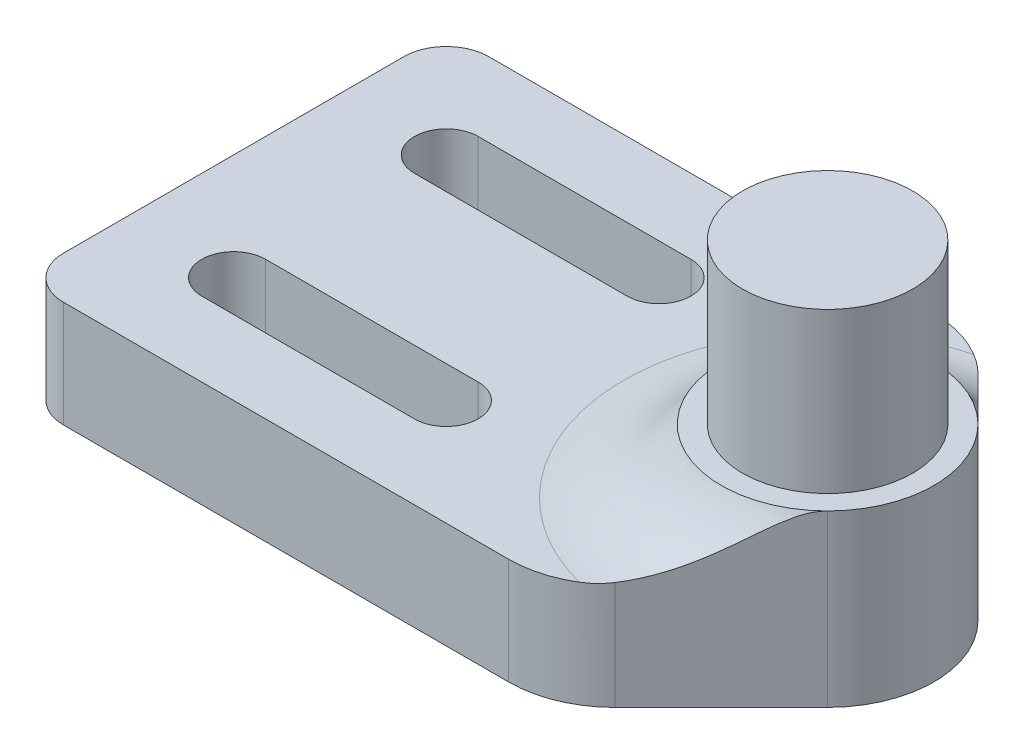
ISO-10303-21;
HEADER;
FILE_DESCRIPTION(('STEP AP214'),'2;1');
FILE_NAME('part.step','',(''),(''),'','','');
FILE_SCHEMA(('AUTOMOTIVE_DESIGN { 1 0 10303 214 1 1 1 1 }'));
ENDSEC;
DATA;
#1=APPLICATION_CONTEXT('core data for automotive mechanical design processes');
#2=APPLICATION_PROTOCOL_DEFINITION('international standard','automotive_design',2000,#1);
#3=PRODUCT_CONTEXT('',#1,'mechanical');
#4=PRODUCT('Part','Part','',(#3));
#5=PRODUCT_RELATED_PRODUCT_CATEGORY('part','',(#4));
#6=PRODUCT_DEFINITION_FORMATION('','',#4);
#7=PRODUCT_DEFINITION_CONTEXT('part definition',#1,'design');
#8=PRODUCT_DEFINITION('design','',#6,#7);
#9=PRODUCT_DEFINITION_SHAPE('','',#8);
#10=(LENGTH_UNIT() NAMED_UNIT(*) SI_UNIT(.MILLI.,.METRE.));
#11=(NAMED_UNIT(*) PLANE_ANGLE_UNIT() SI_UNIT($,.RADIAN.));
#12=(NAMED_UNIT(*) SI_UNIT($,.STERADIAN.) SOLID_ANGLE_UNIT());
#13=UNCERTAINTY_MEASURE_WITH_UNIT(LENGTH_MEASURE(1.E-05),#10,'distance_accuracy_value','');
#14=(GEOMETRIC_REPRESENTATION_CONTEXT(3) GLOBAL_UNCERTAINTY_ASSIGNED_CONTEXT((#13)) GLOBAL_UNIT_ASSIGNED_CONTEXT((#10,
#11,#12)) REPRESENTATION_CONTEXT('',''));
#15=CARTESIAN_POINT('',(0.,0.,0.));
#16=DIRECTION('',(0.,0.,1.));
#17=DIRECTION('',(1.,0.,0.));
#18=AXIS2_PLACEMENT_3D('',#15,#16,#17);
#19=CARTESIAN_POINT('',(0.,5.,0.));
#20=DIRECTION('',(0.,-1.,0.));
#21=DIRECTION('',(0.,0.,-1.));
#22=AXIS2_PLACEMENT_3D('',#19,#20,#21);
#23=PLANE('',#22);
#24=DIRECTION('',(-1.,0.,0.));
#25=VECTOR('',#24,1.);
#26=CARTESIAN_POINT('',(-12.5,5.,-10.));
#27=LINE('',#26,#25);
#28=CARTESIAN_POINT('',(10.4289321881345,5.,-10.));
#29=VERTEX_POINT('',#28);
#30=CARTESIAN_POINT('',(-10.5,5.,-10.));
#31=VERTEX_POINT('',#30);
#32=EDGE_CURVE('E259',#29,#31,#27,.T.);
#33=ORIENTED_EDGE('',*,*,#32,.T.);
#34=CARTESIAN_POINT('',(-10.5,5.,-8.00000000000001));
#35=DIRECTION('',(0.,-1.,0.));
#36=DIRECTION('',(0.,0.,-1.));
#37=AXIS2_PLACEMENT_3D('',#34,#35,#36);
#38=CIRCLE('',#37,2.);
#39=CARTESIAN_POINT('',(-12.5,5.,-8.));
#40=VERTEX_POINT('',#39);
#41=EDGE_CURVE('E41',#31,#40,#38,.F.);
#42=ORIENTED_EDGE('',*,*,#41,.T.);
#43=DIRECTION('',(0.,0.,1.));
#44=VECTOR('',#43,1.);
#45=CARTESIAN_POINT('',(-12.5,5.,10.));
#46=LINE('',#45,#44);
#47=CARTESIAN_POINT('',(-12.5,5.,8.));
#48=VERTEX_POINT('',#47);
#49=EDGE_CURVE('E258',#40,#48,#46,.T.);
#50=ORIENTED_EDGE('',*,*,#49,.T.);
#51=CARTESIAN_POINT('',(-10.5,5.,8.));
#52=DIRECTION('',(0.,-1.,0.));
#53=DIRECTION('',(0.,0.,-1.));
#54=AXIS2_PLACEMENT_3D('',#51,#52,#53);
#55=CIRCLE('',#54,2.);
#56=CARTESIAN_POINT('',(-10.5,5.,10.));
#57=VERTEX_POINT('',#56);
#58=EDGE_CURVE('E48',#48,#57,#55,.F.);
#59=ORIENTED_EDGE('',*,*,#58,.T.);
#60=DIRECTION('',(1.,0.,0.));
#61=VECTOR('',#60,1.);
#62=CARTESIAN_POINT('',(-12.5,5.,10.));
#63=LINE('',#62,#61);
#64=CARTESIAN_POINT('',(10.4289321881345,5.,10.));
#65=VERTEX_POINT('',#64);
#66=EDGE_CURVE('E266',#57,#65,#63,.T.);
#67=ORIENTED_EDGE('',*,*,#66,.T.);
#68=CARTESIAN_POINT('',(10.4289321881345,5.,5.));
#69=DIRECTION('',(0.,-1.,0.));
#70=DIRECTION('',(0.,0.,-1.));
#71=AXIS2_PLACEMENT_3D('',#68,#69,#70);
#72=CIRCLE('',#71,5.);
#73=CARTESIAN_POINT('',(13.0216266873913,5.,9.27527019421269));
#74=VERTEX_POINT('',#73);
#75=EDGE_CURVE('E293',#65,#74,#72,.F.);
#76=ORIENTED_EDGE('',*,*,#75,.T.);
#77=CARTESIAN_POINT('',(15.4289321881345,5.,0.));
#78=DIRECTION('',(0.,-1.,0.));
#79=DIRECTION('',(0.,0.,-1.));
#80=AXIS2_PLACEMENT_3D('',#77,#78,#79);
#81=CIRCLE('',#80,9.58257569495584);
#82=CARTESIAN_POINT('',(13.0216266873913,5.,-9.27527019421269));
#83=VERTEX_POINT('',#82);
#84=EDGE_CURVE('E204',#74,#83,#81,.T.);
#85=ORIENTED_EDGE('',*,*,#84,.T.);
#86=CARTESIAN_POINT('',(10.4289321881345,5.,-5.));
#87=DIRECTION('',(0.,-1.,0.));
#88=DIRECTION('',(0.,0.,-1.));
#89=AXIS2_PLACEMENT_3D('',#86,#87,#88);
#90=CIRCLE('',#89,5.);
#91=EDGE_CURVE('E296',#83,#29,#90,.F.);
#92=ORIENTED_EDGE('',*,*,#91,.T.);
#93=EDGE_LOOP('',(#33,#42,#50,#59,#67,#76,#85,#92));
#94=FACE_BOUND('',#93,.T.);
#95=CARTESIAN_POINT('',(-7.50000000000001,5.,-5.));
#96=DIRECTION('',(0.,1.,0.));
#97=DIRECTION('',(0.,0.,1.));
#98=AXIS2_PLACEMENT_3D('',#95,#96,#97);
#99=CIRCLE('',#98,1.5);
#100=CARTESIAN_POINT('',(-7.50000000000001,5.,-6.49999999999999));
#101=VERTEX_POINT('',#100);
#102=CARTESIAN_POINT('',(-7.50000000000001,5.,-3.5));
#103=VERTEX_POINT('',#102);
#104=EDGE_CURVE('E329',#101,#103,#99,.T.);
#105=ORIENTED_EDGE('',*,*,#104,.F.);
#106=DIRECTION('',(-1.,0.,0.));
#107=VECTOR('',#106,1.);
#108=CARTESIAN_POINT('',(-7.50000000000001,5.,-6.49999999999999));
#109=LINE('',#108,#107);
#110=CARTESIAN_POINT('',(2.49999999999999,5.,-6.5));
#111=VERTEX_POINT('',#110);
#112=EDGE_CURVE('E325',#111,#101,#109,.T.);
#113=ORIENTED_EDGE('',*,*,#112,.F.);
#114=CARTESIAN_POINT('',(2.5,5.,-5.));
#115=DIRECTION('',(0.,1.,0.));
#116=DIRECTION('',(0.,0.,1.));
#117=AXIS2_PLACEMENT_3D('',#114,#115,#116);
#118=CIRCLE('',#117,1.5);
#119=CARTESIAN_POINT('',(2.5,5.,-3.5));
#120=VERTEX_POINT('',#119);
#121=EDGE_CURVE('E341',#120,#111,#118,.T.);
#122=ORIENTED_EDGE('',*,*,#121,.F.);
#123=DIRECTION('',(1.,0.,0.));
#124=VECTOR('',#123,1.);
#125=CARTESIAN_POINT('',(-7.50000000000001,5.,-3.5));
#126=LINE('',#125,#124);
#127=EDGE_CURVE('E344',#103,#120,#126,.T.);
#128=ORIENTED_EDGE('',*,*,#127,.F.);
#129=EDGE_LOOP('',(#105,#113,#122,#128));
#130=FACE_BOUND('',#129,.T.);
#131=CARTESIAN_POINT('',(-7.50000000000001,5.,5.));
#132=DIRECTION('',(0.,1.,0.));
#133=DIRECTION('',(0.,0.,-1.));
#134=AXIS2_PLACEMENT_3D('',#131,#132,#133);
#135=CIRCLE('',#134,1.5);
#136=CARTESIAN_POINT('',(-7.50000000000001,5.,3.5));
#137=VERTEX_POINT('',#136);
#138=CARTESIAN_POINT('',(-7.50000000000001,5.,6.5));
#139=VERTEX_POINT('',#138);
#140=EDGE_CURVE('E360',#137,#139,#135,.T.);
#141=ORIENTED_EDGE('',*,*,#140,.F.);
#142=DIRECTION('',(-1.,0.,0.));
#143=VECTOR('',#142,1.);
#144=CARTESIAN_POINT('',(-7.50000000000001,5.,3.5));
#145=LINE('',#144,#143);
#146=CARTESIAN_POINT('',(2.50000000000001,5.,3.5));
#147=VERTEX_POINT('',#146);
#148=EDGE_CURVE('E356',#147,#137,#145,.T.);
#149=ORIENTED_EDGE('',*,*,#148,.F.);
#150=CARTESIAN_POINT('',(2.5,5.,5.));
#151=DIRECTION('',(0.,1.,0.));
#152=DIRECTION('',(0.,0.,-1.));
#153=AXIS2_PLACEMENT_3D('',#150,#151,#152);
#154=CIRCLE('',#153,1.5);
#155=CARTESIAN_POINT('',(2.49999999999999,5.,6.5));
#156=VERTEX_POINT('',#155);
#157=EDGE_CURVE('E370',#156,#147,#154,.T.);
#158=ORIENTED_EDGE('',*,*,#157,.F.);
#159=DIRECTION('',(1.,0.,0.));
#160=VECTOR('',#159,1.);
#161=CARTESIAN_POINT('',(-7.50000000000001,5.,6.5));
#162=LINE('',#161,#160);
#163=EDGE_CURVE('E373',#139,#156,#162,.T.);
#164=ORIENTED_EDGE('',*,*,#163,.F.);
#165=EDGE_LOOP('',(#141,#149,#158,#164));
#166=FACE_BOUND('',#165,.T.);
#167=ADVANCED_FACE('F33',(#94,#130,#166),#23,.F.);
#168=CARTESIAN_POINT('',(0.,0.,0.));
#169=DIRECTION('',(0.,-1.,0.));
#170=DIRECTION('',(0.,0.,-1.));
#171=AXIS2_PLACEMENT_3D('',#168,#169,#170);
#172=PLANE('',#171);
#173=DIRECTION('',(0.,0.,1.));
#174=VECTOR('',#173,1.);
#175=CARTESIAN_POINT('',(-12.5,0.,10.));
#176=LINE('',#175,#174);
#177=CARTESIAN_POINT('',(-12.5,0.,-8.));
#178=VERTEX_POINT('',#177);
#179=CARTESIAN_POINT('',(-12.5,0.,8.));
#180=VERTEX_POINT('',#179);
#181=EDGE_CURVE('E271',#178,#180,#176,.T.);
#182=ORIENTED_EDGE('',*,*,#181,.F.);
#183=CARTESIAN_POINT('',(-10.5,0.,-8.00000000000001));
#184=DIRECTION('',(0.,-1.,0.));
#185=DIRECTION('',(0.,0.,-1.));
#186=AXIS2_PLACEMENT_3D('',#183,#184,#185);
#187=CIRCLE('',#186,2.);
#188=CARTESIAN_POINT('',(-10.5,0.,-10.));
#189=VERTEX_POINT('',#188);
#190=EDGE_CURVE('E252',#178,#189,#187,.T.);
#191=ORIENTED_EDGE('',*,*,#190,.T.);
#192=DIRECTION('',(-1.,0.,0.));
#193=VECTOR('',#192,1.);
#194=CARTESIAN_POINT('',(-12.5,0.,-10.));
#195=LINE('',#194,#193);
#196=CARTESIAN_POINT('',(10.4289321881345,0.,-10.));
#197=VERTEX_POINT('',#196);
#198=EDGE_CURVE('E270',#197,#189,#195,.T.);
#199=ORIENTED_EDGE('',*,*,#198,.F.);
#200=CARTESIAN_POINT('',(10.4289321881345,0.,-5.));
#201=DIRECTION('',(0.,-1.,0.));
#202=DIRECTION('',(0.,0.,-1.));
#203=AXIS2_PLACEMENT_3D('',#200,#201,#202);
#204=CIRCLE('',#203,5.);
#205=CARTESIAN_POINT('',(13.9644660940673,0.,-8.53553390593272));
#206=VERTEX_POINT('',#205);
#207=EDGE_CURVE('E289',#197,#206,#204,.T.);
#208=ORIENTED_EDGE('',*,*,#207,.T.);
#209=DIRECTION('',(-0.707106781186544,0.,-0.707106781186551));
#210=VECTOR('',#209,1.);
#211=CARTESIAN_POINT('',(12.5,0.,-10.));
#212=LINE('',#211,#210);
#213=CARTESIAN_POINT('',(18.9644660940672,0.,-3.53553390593272));
#214=VERTEX_POINT('',#213);
#215=EDGE_CURVE('E177',#214,#206,#212,.T.);
#216=ORIENTED_EDGE('',*,*,#215,.F.);
#217=CARTESIAN_POINT('',(15.4289321881345,0.,0.));
#218=DIRECTION('',(0.,-1.,0.));
#219=DIRECTION('',(0.,0.,-1.));
#220=AXIS2_PLACEMENT_3D('',#217,#218,#219);
#221=CIRCLE('',#220,5.);
#222=CARTESIAN_POINT('',(18.9644660940672,0.,3.53553390593272));
#223=VERTEX_POINT('',#222);
#224=EDGE_CURVE('E180',#223,#214,#221,.F.);
#225=ORIENTED_EDGE('',*,*,#224,.F.);
#226=DIRECTION('',(0.707106781186544,0.,-0.707106781186551));
#227=VECTOR('',#226,1.);
#228=CARTESIAN_POINT('',(18.9644660940672,0.,3.53553390593272));
#229=LINE('',#228,#227);
#230=CARTESIAN_POINT('',(13.9644660940673,0.,8.53553390593272));
#231=VERTEX_POINT('',#230);
#232=EDGE_CURVE('E167',#231,#223,#229,.T.);
#233=ORIENTED_EDGE('',*,*,#232,.F.);
#234=CARTESIAN_POINT('',(10.4289321881345,0.,5.));
#235=DIRECTION('',(0.,-1.,0.));
#236=DIRECTION('',(0.,0.,-1.));
#237=AXIS2_PLACEMENT_3D('',#234,#235,#236);
#238=CIRCLE('',#237,5.);
#239=CARTESIAN_POINT('',(10.4289321881345,0.,10.));
#240=VERTEX_POINT('',#239);
#241=EDGE_CURVE('E287',#231,#240,#238,.T.);
#242=ORIENTED_EDGE('',*,*,#241,.T.);
#243=DIRECTION('',(1.,0.,0.));
#244=VECTOR('',#243,1.);
#245=CARTESIAN_POINT('',(-12.5,0.,10.));
#246=LINE('',#245,#244);
#247=CARTESIAN_POINT('',(-10.5,0.,10.));
#248=VERTEX_POINT('',#247);
#249=EDGE_CURVE('E278',#248,#240,#246,.T.);
#250=ORIENTED_EDGE('',*,*,#249,.F.);
#251=CARTESIAN_POINT('',(-10.5,0.,8.));
#252=DIRECTION('',(0.,-1.,0.));
#253=DIRECTION('',(0.,0.,-1.));
#254=AXIS2_PLACEMENT_3D('',#251,#252,#253);
#255=CIRCLE('',#254,2.);
#256=EDGE_CURVE('E250',#248,#180,#255,.T.);
#257=ORIENTED_EDGE('',*,*,#256,.T.);
#258=EDGE_LOOP('',(#182,#191,#199,#208,#216,#225,#233,#242,#250,#257));
#259=FACE_BOUND('',#258,.T.);
#260=DIRECTION('',(-1.,0.,0.));
#261=VECTOR('',#260,1.);
#262=CARTESIAN_POINT('',(-7.50000000000001,0.,-6.49999999999999));
#263=LINE('',#262,#261);
#264=CARTESIAN_POINT('',(2.49999999999999,0.,-6.5));
#265=VERTEX_POINT('',#264);
#266=CARTESIAN_POINT('',(-7.50000000000001,0.,-6.49999999999999));
#267=VERTEX_POINT('',#266);
#268=EDGE_CURVE('E326',#265,#267,#263,.T.);
#269=ORIENTED_EDGE('',*,*,#268,.T.);
#270=CARTESIAN_POINT('',(-7.50000000000001,0.,-5.));
#271=DIRECTION('',(0.,1.,0.));
#272=DIRECTION('',(0.,0.,1.));
#273=AXIS2_PLACEMENT_3D('',#270,#271,#272);
#274=CIRCLE('',#273,1.5);
#275=CARTESIAN_POINT('',(-7.50000000000001,0.,-3.5));
#276=VERTEX_POINT('',#275);
#277=EDGE_CURVE('E336',#267,#276,#274,.T.);
#278=ORIENTED_EDGE('',*,*,#277,.T.);
#279=DIRECTION('',(1.,0.,0.));
#280=VECTOR('',#279,1.);
#281=CARTESIAN_POINT('',(-7.50000000000001,0.,-3.5));
#282=LINE('',#281,#280);
#283=CARTESIAN_POINT('',(2.5,0.,-3.5));
#284=VERTEX_POINT('',#283);
#285=EDGE_CURVE('E333',#276,#284,#282,.T.);
#286=ORIENTED_EDGE('',*,*,#285,.T.);
#287=CARTESIAN_POINT('',(2.5,0.,-5.));
#288=DIRECTION('',(0.,1.,0.));
#289=DIRECTION('',(0.,0.,1.));
#290=AXIS2_PLACEMENT_3D('',#287,#288,#289);
#291=CIRCLE('',#290,1.5);
#292=EDGE_CURVE('E330',#284,#265,#291,.T.);
#293=ORIENTED_EDGE('',*,*,#292,.T.);
#294=EDGE_LOOP('',(#269,#278,#286,#293));
#295=FACE_BOUND('',#294,.T.);
#296=DIRECTION('',(-1.,0.,0.));
#297=VECTOR('',#296,1.);
#298=CARTESIAN_POINT('',(-7.50000000000001,0.,3.5));
#299=LINE('',#298,#297);
#300=CARTESIAN_POINT('',(2.50000000000001,0.,3.5));
#301=VERTEX_POINT('',#300);
#302=CARTESIAN_POINT('',(-7.50000000000001,0.,3.5));
#303=VERTEX_POINT('',#302);
#304=EDGE_CURVE('E357',#301,#303,#299,.T.);
#305=ORIENTED_EDGE('',*,*,#304,.T.);
#306=CARTESIAN_POINT('',(-7.50000000000001,0.,5.));
#307=DIRECTION('',(0.,1.,0.));
#308=DIRECTION('',(0.,0.,-1.));
#309=AXIS2_PLACEMENT_3D('',#306,#307,#308);
#310=CIRCLE('',#309,1.5);
#311=CARTESIAN_POINT('',(-7.50000000000001,0.,6.5));
#312=VERTEX_POINT('',#311);
#313=EDGE_CURVE('E201',#303,#312,#310,.T.);
#314=ORIENTED_EDGE('',*,*,#313,.T.);
#315=DIRECTION('',(1.,0.,0.));
#316=VECTOR('',#315,1.);
#317=CARTESIAN_POINT('',(-7.50000000000001,0.,6.5));
#318=LINE('',#317,#316);
#319=CARTESIAN_POINT('',(2.49999999999999,0.,6.5));
#320=VERTEX_POINT('',#319);
#321=EDGE_CURVE('E364',#312,#320,#318,.T.);
#322=ORIENTED_EDGE('',*,*,#321,.T.);
#323=CARTESIAN_POINT('',(2.5,0.,5.));
#324=DIRECTION('',(0.,1.,0.));
#325=DIRECTION('',(0.,0.,-1.));
#326=AXIS2_PLACEMENT_3D('',#323,#324,#325);
#327=CIRCLE('',#326,1.5);
#328=EDGE_CURVE('E361',#320,#301,#327,.T.);
#329=ORIENTED_EDGE('',*,*,#328,.T.);
#330=EDGE_LOOP('',(#305,#314,#322,#329));
#331=FACE_BOUND('',#330,.T.);
#332=ADVANCED_FACE('F182',(#259,#295,#331),#172,.T.);
#333=CARTESIAN_POINT('',(-12.5,5.,-10.));
#334=DIRECTION('',(0.,0.,1.));
#335=DIRECTION('',(1.,0.,0.));
#336=AXIS2_PLACEMENT_3D('',#333,#334,#335);
#337=PLANE('',#336);
#338=ORIENTED_EDGE('',*,*,#198,.T.);
#339=DIRECTION('',(0.,-1.,0.));
#340=VECTOR('',#339,1.);
#341=CARTESIAN_POINT('',(-10.5,5.,-10.));
#342=LINE('',#341,#340);
#343=EDGE_CURVE('E56',#189,#31,#342,.F.);
#344=ORIENTED_EDGE('',*,*,#343,.T.);
#345=ORIENTED_EDGE('',*,*,#32,.F.);
#346=DIRECTION('',(0.,-1.,0.));
#347=VECTOR('',#346,1.);
#348=CARTESIAN_POINT('',(10.4289321881345,0.,-10.));
#349=LINE('',#348,#347);
#350=EDGE_CURVE('E275',#29,#197,#349,.T.);
#351=ORIENTED_EDGE('',*,*,#350,.T.);
#352=EDGE_LOOP('',(#338,#344,#345,#351));
#353=FACE_BOUND('',#352,.T.);
#354=ADVANCED_FACE('F273',(#353),#337,.F.);
#355=CARTESIAN_POINT('',(-12.5,5.,10.));
#356=DIRECTION('',(1.,0.,0.));
#357=DIRECTION('',(0.,0.,-1.));
#358=AXIS2_PLACEMENT_3D('',#355,#356,#357);
#359=PLANE('',#358);
#360=ORIENTED_EDGE('',*,*,#49,.F.);
#361=DIRECTION('',(0.,-1.,0.));
#362=VECTOR('',#361,1.);
#363=CARTESIAN_POINT('',(-12.5,5.,-8.00000000000001));
#364=LINE('',#363,#362);
#365=EDGE_CURVE('E247',#40,#178,#364,.T.);
#366=ORIENTED_EDGE('',*,*,#365,.T.);
#367=ORIENTED_EDGE('',*,*,#181,.T.);
#368=DIRECTION('',(0.,-1.,0.));
#369=VECTOR('',#368,1.);
#370=CARTESIAN_POINT('',(-12.5,5.,8.));
#371=LINE('',#370,#369);
#372=EDGE_CURVE('E240',#180,#48,#371,.F.);
#373=ORIENTED_EDGE('',*,*,#372,.T.);
#374=EDGE_LOOP('',(#360,#366,#367,#373));
#375=FACE_BOUND('',#374,.T.);
#376=ADVANCED_FACE('F263',(#375),#359,.F.);
#377=CARTESIAN_POINT('',(-12.5,5.,10.));
#378=DIRECTION('',(0.,0.,-1.));
#379=DIRECTION('',(-1.,0.,0.));
#380=AXIS2_PLACEMENT_3D('',#377,#378,#379);
#381=PLANE('',#380);
#382=ORIENTED_EDGE('',*,*,#66,.F.);
#383=DIRECTION('',(0.,-1.,0.));
#384=VECTOR('',#383,1.);
#385=CARTESIAN_POINT('',(-10.5,5.,10.));
#386=LINE('',#385,#384);
#387=EDGE_CURVE('E11',#57,#248,#386,.T.);
#388=ORIENTED_EDGE('',*,*,#387,.T.);
#389=ORIENTED_EDGE('',*,*,#249,.T.);
#390=DIRECTION('',(0.,-1.,0.));
#391=VECTOR('',#390,1.);
#392=CARTESIAN_POINT('',(10.4289321881345,5.,10.));
#393=LINE('',#392,#391);
#394=EDGE_CURVE('E196',#240,#65,#393,.F.);
#395=ORIENTED_EDGE('',*,*,#394,.T.);
#396=EDGE_LOOP('',(#382,#388,#389,#395));
#397=FACE_BOUND('',#396,.T.);
#398=ADVANCED_FACE('F301',(#397),#381,.F.);
#399=CARTESIAN_POINT('',(-7.50000000000001,5.,-5.));
#400=DIRECTION('',(0.,-1.,0.));
#401=DIRECTION('',(0.,0.,-1.));
#402=AXIS2_PLACEMENT_3D('',#399,#400,#401);
#403=CYLINDRICAL_SURFACE('',#402,1.5);
#404=ORIENTED_EDGE('',*,*,#277,.F.);
#405=DIRECTION('',(0.,-1.,0.));
#406=VECTOR('',#405,1.);
#407=CARTESIAN_POINT('',(-7.50000000000001,5.,-6.49999999999999));
#408=LINE('',#407,#406);
#409=EDGE_CURVE('E322',#101,#267,#408,.T.);
#410=ORIENTED_EDGE('',*,*,#409,.F.);
#411=ORIENTED_EDGE('',*,*,#104,.T.);
#412=DIRECTION('',(0.,-1.,0.));
#413=VECTOR('',#412,1.);
#414=CARTESIAN_POINT('',(-7.50000000000001,5.,-3.5));
#415=LINE('',#414,#413);
#416=EDGE_CURVE('E276',#103,#276,#415,.T.);
#417=ORIENTED_EDGE('',*,*,#416,.T.);
#418=EDGE_LOOP('',(#404,#410,#411,#417));
#419=FACE_BOUND('',#418,.T.);
#420=ADVANCED_FACE('F408',(#419),#403,.F.);
#421=CARTESIAN_POINT('',(-7.50000000000001,5.,-3.5));
#422=DIRECTION('',(0.,0.,-1.));
#423=DIRECTION('',(-1.,0.,0.));
#424=AXIS2_PLACEMENT_3D('',#421,#422,#423);
#425=PLANE('',#424);
#426=ORIENTED_EDGE('',*,*,#285,.F.);
#427=ORIENTED_EDGE('',*,*,#416,.F.);
#428=ORIENTED_EDGE('',*,*,#127,.T.);
#429=DIRECTION('',(0.,-1.,0.));
#430=VECTOR('',#429,1.);
#431=CARTESIAN_POINT('',(2.5,5.,-3.5));
#432=LINE('',#431,#430);
#433=EDGE_CURVE('E281',#120,#284,#432,.T.);
#434=ORIENTED_EDGE('',*,*,#433,.T.);
#435=EDGE_LOOP('',(#426,#427,#428,#434));
#436=FACE_BOUND('',#435,.T.);
#437=ADVANCED_FACE('F505',(#436),#425,.T.);
#438=CARTESIAN_POINT('',(2.5,5.,-5.));
#439=DIRECTION('',(0.,-1.,0.));
#440=DIRECTION('',(0.,0.,-1.));
#441=AXIS2_PLACEMENT_3D('',#438,#439,#440);
#442=CYLINDRICAL_SURFACE('',#441,1.5);
#443=ORIENTED_EDGE('',*,*,#292,.F.);
#444=ORIENTED_EDGE('',*,*,#433,.F.);
#445=ORIENTED_EDGE('',*,*,#121,.T.);
#446=DIRECTION('',(0.,-1.,0.));
#447=VECTOR('',#446,1.);
#448=CARTESIAN_POINT('',(2.49999999999999,5.,-6.5));
#449=LINE('',#448,#447);
#450=EDGE_CURVE('E320',#111,#265,#449,.T.);
#451=ORIENTED_EDGE('',*,*,#450,.T.);
#452=EDGE_LOOP('',(#443,#444,#445,#451));
#453=FACE_BOUND('',#452,.T.);
#454=ADVANCED_FACE('F495',(#453),#442,.F.);
#455=CARTESIAN_POINT('',(-7.50000000000001,5.,-6.49999999999999));
#456=DIRECTION('',(0.,0.,1.));
#457=DIRECTION('',(1.,0.,0.));
#458=AXIS2_PLACEMENT_3D('',#455,#456,#457);
#459=PLANE('',#458);
#460=ORIENTED_EDGE('',*,*,#268,.F.);
#461=ORIENTED_EDGE('',*,*,#450,.F.);
#462=ORIENTED_EDGE('',*,*,#112,.T.);
#463=ORIENTED_EDGE('',*,*,#409,.T.);
#464=EDGE_LOOP('',(#460,#461,#462,#463));
#465=FACE_BOUND('',#464,.T.);
#466=ADVANCED_FACE('F485',(#465),#459,.T.);
#467=CARTESIAN_POINT('',(-7.50000000000001,5.,5.));
#468=DIRECTION('',(0.,-1.,0.));
#469=DIRECTION('',(0.,0.,-1.));
#470=AXIS2_PLACEMENT_3D('',#467,#468,#469);
#471=CYLINDRICAL_SURFACE('',#470,1.5);
#472=ORIENTED_EDGE('',*,*,#313,.F.);
#473=DIRECTION('',(0.,-1.,0.));
#474=VECTOR('',#473,1.);
#475=CARTESIAN_POINT('',(-7.50000000000001,5.,3.5));
#476=LINE('',#475,#474);
#477=EDGE_CURVE('E353',#137,#303,#476,.T.);
#478=ORIENTED_EDGE('',*,*,#477,.F.);
#479=ORIENTED_EDGE('',*,*,#140,.T.);
#480=DIRECTION('',(0.,-1.,0.));
#481=VECTOR('',#480,1.);
#482=CARTESIAN_POINT('',(-7.50000000000001,5.,6.5));
#483=LINE('',#482,#481);
#484=EDGE_CURVE('E339',#139,#312,#483,.T.);
#485=ORIENTED_EDGE('',*,*,#484,.T.);
#486=EDGE_LOOP('',(#472,#478,#479,#485));
#487=FACE_BOUND('',#486,.T.);
#488=ADVANCED_FACE('F475',(#487),#471,.F.);
#489=CARTESIAN_POINT('',(-7.50000000000001,5.,6.5));
#490=DIRECTION('',(0.,0.,-1.));
#491=DIRECTION('',(-1.,0.,0.));
#492=AXIS2_PLACEMENT_3D('',#489,#490,#491);
#493=PLANE('',#492);
#494=ORIENTED_EDGE('',*,*,#321,.F.);
#495=ORIENTED_EDGE('',*,*,#484,.F.);
#496=ORIENTED_EDGE('',*,*,#163,.T.);
#497=DIRECTION('',(0.,-1.,0.));
#498=VECTOR('',#497,1.);
#499=CARTESIAN_POINT('',(2.49999999999999,5.,6.5));
#500=LINE('',#499,#498);
#501=EDGE_CURVE('E349',#156,#320,#500,.T.);
#502=ORIENTED_EDGE('',*,*,#501,.T.);
#503=EDGE_LOOP('',(#494,#495,#496,#502));
#504=FACE_BOUND('',#503,.T.);
#505=ADVANCED_FACE('F466',(#504),#493,.T.);
#506=CARTESIAN_POINT('',(2.5,5.,5.));
#507=DIRECTION('',(0.,-1.,0.));
#508=DIRECTION('',(0.,0.,-1.));
#509=AXIS2_PLACEMENT_3D('',#506,#507,#508);
#510=CYLINDRICAL_SURFACE('',#509,1.5);
#511=ORIENTED_EDGE('',*,*,#328,.F.);
#512=ORIENTED_EDGE('',*,*,#501,.F.);
#513=ORIENTED_EDGE('',*,*,#157,.T.);
#514=DIRECTION('',(0.,-1.,0.));
#515=VECTOR('',#514,1.);
#516=CARTESIAN_POINT('',(2.50000000000001,5.,3.5));
#517=LINE('',#516,#515);
#518=EDGE_CURVE('E351',#147,#301,#517,.T.);
#519=ORIENTED_EDGE('',*,*,#518,.T.);
#520=EDGE_LOOP('',(#511,#512,#513,#519));
#521=FACE_BOUND('',#520,.T.);
#522=ADVANCED_FACE('F456',(#521),#510,.F.);
#523=CARTESIAN_POINT('',(-7.50000000000001,5.,3.5));
#524=DIRECTION('',(0.,0.,1.));
#525=DIRECTION('',(1.,0.,0.));
#526=AXIS2_PLACEMENT_3D('',#523,#524,#525);
#527=PLANE('',#526);
#528=ORIENTED_EDGE('',*,*,#304,.F.);
#529=ORIENTED_EDGE('',*,*,#518,.F.);
#530=ORIENTED_EDGE('',*,*,#148,.T.);
#531=ORIENTED_EDGE('',*,*,#477,.T.);
#532=EDGE_LOOP('',(#528,#529,#530,#531));
#533=FACE_BOUND('',#532,.T.);
#534=ADVANCED_FACE('F230',(#533),#527,.T.);
#535=CARTESIAN_POINT('',(12.5,-21.5143664941368,-10.));
#536=DIRECTION('',(0.707106781186551,0.,-0.707106781186544));
#537=DIRECTION('',(-0.707106781186544,0.,-0.707106781186551));
#538=AXIS2_PLACEMENT_3D('',#535,#536,#537);
#539=PLANE('',#538);
#540=ORIENTED_EDGE('',*,*,#215,.T.);
#541=DIRECTION('',(0.,-1.,0.));
#542=VECTOR('',#541,1.);
#543=CARTESIAN_POINT('',(13.9644660940673,5.,-8.53553390593272));
#544=LINE('',#543,#542);
#545=CARTESIAN_POINT('',(13.9644660940673,5.08580395580079,-8.53553390593272));
#546=VERTEX_POINT('',#545);
#547=EDGE_CURVE('E291',#206,#546,#544,.F.);
#548=ORIENTED_EDGE('',*,*,#547,.T.);
#549=CARTESIAN_POINT('',(13.9644660940673,5.08580395580079,-8.53553390593272));
#550=CARTESIAN_POINT('',(14.0554047952654,5.10551050023809,-8.44459520473458));
#551=CARTESIAN_POINT('',(14.145971427771,5.12844521292076,-8.35402857222901));
#552=CARTESIAN_POINT('',(14.326200513733,5.18038911249688,-8.17379948626694));
#553=CARTESIAN_POINT('',(14.4158632532157,5.20939631026926,-8.0841367467843));
#554=CARTESIAN_POINT('',(14.6829029169219,5.30481905337515,-7.81709708307808));
#555=CARTESIAN_POINT('',(14.8587829320918,5.37973711982332,-7.64121706790818));
#556=CARTESIAN_POINT('',(15.200909741591,5.54665892989085,-7.29909025840898));
#557=CARTESIAN_POINT('',(15.3672884283975,5.6381325701977,-7.1327115716025));
#558=CARTESIAN_POINT('',(15.6954568497964,5.83632705389244,-6.80454315020357));
#559=CARTESIAN_POINT('',(15.8572452075851,5.94305241506661,-6.64275479241483));
#560=CARTESIAN_POINT('',(16.1965574242539,6.18246660541715,-6.30344257574603));
#561=CARTESIAN_POINT('',(16.3735181035152,6.31673322037704,-6.1264818964848));
#562=CARTESIAN_POINT('',(16.636190336378,6.52525402378646,-5.86380966362199));
#563=CARTESIAN_POINT('',(16.7233314392099,6.59598689707273,-5.77666856079001));
#564=CARTESIAN_POINT('',(16.8969965946616,6.73893324902161,-5.60300340533832));
#565=CARTESIAN_POINT('',(16.9835206928088,6.81114661688566,-5.51647930719116));
#566=CARTESIAN_POINT('',(17.1567158027411,6.95629193897278,-5.34328419725884));
#567=CARTESIAN_POINT('',(17.2433860909556,7.02922559144656,-5.25661390904434));
#568=CARTESIAN_POINT('',(17.4171210201708,7.17414520593354,-5.08287897982918));
#569=CARTESIAN_POINT('',(17.5041856382906,7.24613122200963,-4.99581436170936));
#570=CARTESIAN_POINT('',(17.6793212964901,7.38707544001569,-4.82067870350983));
#571=CARTESIAN_POINT('',(17.7673900943906,7.45603916717159,-4.73260990560936));
#572=CARTESIAN_POINT('',(17.9456552035641,7.58817809605036,-4.55434479643589));
#573=CARTESIAN_POINT('',(18.0358498339282,7.65135769021049,-4.46415016607178));
#574=CARTESIAN_POINT('',(18.180930626081,7.74302647249939,-4.31906937391892));
#575=CARTESIAN_POINT('',(18.2347248897769,7.77493569582876,-4.265275110223));
#576=CARTESIAN_POINT('',(18.3436343295912,7.83406146356489,-4.15636567040878));
#577=CARTESIAN_POINT('',(18.3987500239645,7.86127613134306,-4.10124997603542));
#578=CARTESIAN_POINT('',(18.5098566277496,7.90933339976524,-3.99014337225033));
#579=CARTESIAN_POINT('',(18.5658358757677,7.93022897560589,-3.93416412423223));
#580=CARTESIAN_POINT('',(18.678922395852,7.96442687681207,-3.82107760414793));
#581=CARTESIAN_POINT('',(18.7360283901609,7.97773734343722,-3.76397160983899));
#582=CARTESIAN_POINT('',(18.8217855503664,7.99106068926102,-3.67821444963358));
#583=CARTESIAN_POINT('',(18.8501897375663,7.99439403965366,-3.64981026243366));
#584=CARTESIAN_POINT('',(18.9072155550703,7.9988724044712,-3.59278444492964));
#585=CARTESIAN_POINT('',(18.9358375836193,8.00000723409275,-3.56416241638066));
#586=CARTESIAN_POINT('',(18.9644660940672,8.,-3.53553390593272));
#587=B_SPLINE_CURVE_WITH_KNOTS('',3,(#549,#550,#551,#552,#553,#554,#555,#556,#557,#558,#559,
#560,#561,#562,#563,#564,#565,#566,#567,#568,#569,#570,#571,#572,#573,#574,#575,#576,#577,#578,
#579,#580,#581,#582,#583,#584,#585,#586),.UNSPECIFIED.,.F.,.F.,(4,2,2,2,2,2,2,2,2,2,2,2,2,2,2,2,
2,2,4),(0.,0.390229526550762,0.780331427821253,1.55860264898965,2.31533972172009,
3.07230141764099,3.92394988592622,4.35022329106457,4.77646490999625,5.20435303403004,
5.63221664020998,6.05926229432445,6.4859809147562,6.73336047079292,6.98083868773945,
7.22618070136397,7.47125888577502,7.59212790017889,7.71355552239348),.UNSPECIFIED.);
#588=CARTESIAN_POINT('',(18.9644660940672,8.,-3.53553390593272));
#589=VERTEX_POINT('',#588);
#590=EDGE_CURVE('E234',#546,#589,#587,.T.);
#591=ORIENTED_EDGE('',*,*,#590,.T.);
#592=DIRECTION('',(0.,1.,0.));
#593=VECTOR('',#592,1.);
#594=CARTESIAN_POINT('',(18.9644660940672,-21.5143664941368,-3.53553390593272));
#595=LINE('',#594,#593);
#596=EDGE_CURVE('E187',#214,#589,#595,.T.);
#597=ORIENTED_EDGE('',*,*,#596,.F.);
#598=EDGE_LOOP('',(#540,#548,#591,#597));
#599=FACE_BOUND('',#598,.T.);
#600=ADVANCED_FACE('F225',(#599),#539,.T.);
#601=CARTESIAN_POINT('',(18.9644660940672,-21.5143664941368,3.53553390593272));
#602=DIRECTION('',(0.707106781186551,0.,0.707106781186544));
#603=DIRECTION('',(0.707106781186544,0.,-0.707106781186551));
#604=AXIS2_PLACEMENT_3D('',#601,#602,#603);
#605=PLANE('',#604);
#606=DIRECTION('',(0.,1.,0.));
#607=VECTOR('',#606,1.);
#608=CARTESIAN_POINT('',(18.9644660940672,-21.5143664941368,3.53553390593272));
#609=LINE('',#608,#607);
#610=CARTESIAN_POINT('',(18.9644660940672,8.,3.53553390593272));
#611=VERTEX_POINT('',#610);
#612=EDGE_CURVE('E172',#223,#611,#609,.T.);
#613=ORIENTED_EDGE('',*,*,#612,.T.);
#614=CARTESIAN_POINT('',(18.9644660940672,8.,3.53553390593272));
#615=CARTESIAN_POINT('',(18.9346304113126,8.00000869031371,3.56536958868735));
#616=CARTESIAN_POINT('',(18.9048019674734,7.9987753099378,3.59519803252651));
#617=CARTESIAN_POINT('',(18.8452570458562,7.99390272635013,3.65474295414372));
#618=CARTESIAN_POINT('',(18.8155405221561,7.99026465091304,3.68445947784387));
#619=CARTESIAN_POINT('',(18.7269736932054,7.97590932939658,3.77302630679454));
#620=CARTESIAN_POINT('',(18.668391592596,7.96174932225276,3.83160840740394));
#621=CARTESIAN_POINT('',(18.5534027603465,7.92585152849461,3.94659723965343));
#622=CARTESIAN_POINT('',(18.4969763702968,7.90423492599988,4.00302362970318));
#623=CARTESIAN_POINT('',(18.3854343131336,7.85491512880381,4.11456568686634));
#624=CARTESIAN_POINT('',(18.3303199756666,7.82720602851586,4.16968002433338));
#625=CARTESIAN_POINT('',(18.1694395536665,7.73860663200627,4.33056044633347));
#626=CARTESIAN_POINT('',(18.0654764379925,7.67126707712625,4.43452356200749));
#627=CARTESIAN_POINT('',(17.8608227277716,7.52717534967533,4.6391772722283));
#628=CARTESIAN_POINT('',(17.7601378759197,7.45040767720768,4.73986212408027));
#629=CARTESIAN_POINT('',(17.560164280122,7.29203647429908,4.9398357198779));
#630=CARTESIAN_POINT('',(17.4608829540102,7.21041440488343,5.03911704598971));
#631=CARTESIAN_POINT('',(17.2630124306708,7.04576637495297,5.23698756932915));
#632=CARTESIAN_POINT('',(17.1644227881396,6.96274146322868,5.33557721186035));
#633=CARTESIAN_POINT('',(16.964991224868,6.79562806477989,5.53500877513193));
#634=CARTESIAN_POINT('',(16.8641440317183,6.71155196483022,5.63585596828168));
#635=CARTESIAN_POINT('',(16.6615020402235,6.54563944734973,5.83849795977648));
#636=CARTESIAN_POINT('',(16.5597070749184,6.46380343483522,5.94029292508153));
#637=CARTESIAN_POINT('',(16.3549430939827,6.30385637494425,6.14505690601728));
#638=CARTESIAN_POINT('',(16.2519771103479,6.2257376194006,6.24802288965204));
#639=CARTESIAN_POINT('',(16.0443513971721,6.07414656464256,6.45564860282781));
#640=CARTESIAN_POINT('',(15.9396917609446,6.00067401052845,6.5603082390554));
#641=CARTESIAN_POINT('',(15.6869653938623,5.8316048203011,6.81303460613771));
#642=CARTESIAN_POINT('',(15.5380003624602,5.73865761698356,6.96199963753974));
#643=CARTESIAN_POINT('',(15.2361897276845,5.56620945500725,7.2638102723155));
#644=CARTESIAN_POINT('',(15.0833438774565,5.48670935417951,7.41665612254351));
#645=CARTESIAN_POINT('',(14.7714704342854,5.34238346987458,7.72852956571461));
#646=CARTESIAN_POINT('',(14.6123831291501,5.2778119373004,7.88761687084987));
#647=CARTESIAN_POINT('',(14.2907799018654,5.16723566364587,8.20922009813462));
#648=CARTESIAN_POINT('',(14.1282591644484,5.12125911068279,8.37174083555163));
#649=CARTESIAN_POINT('',(13.9644660940673,5.08580395580079,8.53553390593272));
#650=B_SPLINE_CURVE_WITH_KNOTS('',3,(#614,#615,#616,#617,#618,#619,#620,#621,#622,#623,#624,
#625,#626,#627,#628,#629,#630,#631,#632,#633,#634,#635,#636,#637,#638,#639,#640,#641,#642,#643,
#644,#645,#646,#647,#648,#649),.UNSPECIFIED.,.F.,.F.,(4,2,2,2,2,2,2,2,2,2,2,2,2,2,2,2,2,4),(0.,
0.126545287586351,0.253031268938856,0.504676529157491,0.752411036736988,1.00038674563141,
1.48476873488109,1.96995798816688,2.45713679671505,2.94396622131053,3.44062821972425,
3.93737943118619,4.43305116661879,4.92869568489269,5.61907888304832,6.30950610622395,
7.01094446082757,7.71344217549618),.UNSPECIFIED.);
#651=CARTESIAN_POINT('',(13.9644660940673,5.08580395580079,8.53553390593272));
#652=VERTEX_POINT('',#651);
#653=EDGE_CURVE('E206',#611,#652,#650,.T.);
#654=ORIENTED_EDGE('',*,*,#653,.T.);
#655=DIRECTION('',(0.,-1.,0.));
#656=VECTOR('',#655,1.);
#657=CARTESIAN_POINT('',(13.9644660940673,0.,8.53553390593272));
#658=LINE('',#657,#656);
#659=EDGE_CURVE('E174',#652,#231,#658,.T.);
#660=ORIENTED_EDGE('',*,*,#659,.T.);
#661=ORIENTED_EDGE('',*,*,#232,.T.);
#662=EDGE_LOOP('',(#613,#654,#660,#661));
#663=FACE_BOUND('',#662,.T.);
#664=ADVANCED_FACE('F169',(#663),#605,.T.);
#665=CARTESIAN_POINT('',(15.4289321881345,-21.5143664941368,0.));
#666=DIRECTION('',(0.,1.,0.));
#667=DIRECTION('',(0.,0.,1.));
#668=AXIS2_PLACEMENT_3D('',#665,#666,#667);
#669=CYLINDRICAL_SURFACE('',#668,5.);
#670=CARTESIAN_POINT('',(15.4289321881345,8.,0.));
#671=DIRECTION('',(0.,1.,0.));
#672=DIRECTION('',(0.,0.,1.));
#673=AXIS2_PLACEMENT_3D('',#670,#671,#672);
#674=CIRCLE('',#673,5.);
#675=EDGE_CURVE('E192',#611,#589,#674,.T.);
#676=ORIENTED_EDGE('',*,*,#675,.F.);
#677=ORIENTED_EDGE('',*,*,#612,.F.);
#678=ORIENTED_EDGE('',*,*,#224,.T.);
#679=ORIENTED_EDGE('',*,*,#596,.T.);
#680=EDGE_LOOP('',(#676,#677,#678,#679));
#681=FACE_BOUND('',#680,.T.);
#682=ADVANCED_FACE('F190',(#681),#669,.T.);
#683=CARTESIAN_POINT('',(10.4289321881345,5.,-5.));
#684=DIRECTION('',(0.,1.,0.));
#685=DIRECTION('',(0.,0.,1.));
#686=AXIS2_PLACEMENT_3D('',#683,#684,#685);
#687=CYLINDRICAL_SURFACE('',#686,5.);
#688=ORIENTED_EDGE('',*,*,#91,.F.);
#689=CARTESIAN_POINT('',(13.0216266873913,5.,-9.27527019421269));
#690=CARTESIAN_POINT('',(13.1077407579823,5.00000019839371,-9.22305762543358));
#691=CARTESIAN_POINT('',(13.1922771602253,5.00156299568401,-9.16822243826797));
#692=CARTESIAN_POINT('',(13.3573819377005,5.0081505524596,-9.05391069832879));
#693=CARTESIAN_POINT('',(13.4379680691632,5.01315793019614,-8.99445877231735));
#694=CARTESIAN_POINT('',(13.5952269423962,5.02696415899599,-8.87099045485491));
#695=CARTESIAN_POINT('',(13.6718998482125,5.03576285097755,-8.80697425501272));
#696=CARTESIAN_POINT('',(13.8213363340631,5.05754315593639,-8.67445886794055));
#697=CARTESIAN_POINT('',(13.894078288606,5.07054560536245,-8.60593873316513));
#698=CARTESIAN_POINT('',(13.9644660940673,5.08580395580079,-8.53553390593272));
#699=B_SPLINE_CURVE_WITH_KNOTS('',3,(#689,#690,#691,#692,#693,#694,#695,#696,#697,#698),
.UNSPECIFIED.,.F.,.F.,(4,2,2,2,4),(0.,0.302076741658635,0.602640244594702,0.903191137256208,
1.2052551934928),.UNSPECIFIED.);
#700=EDGE_CURVE('E241',#83,#546,#699,.T.);
#701=ORIENTED_EDGE('',*,*,#700,.T.);
#702=ORIENTED_EDGE('',*,*,#547,.F.);
#703=ORIENTED_EDGE('',*,*,#207,.F.);
#704=ORIENTED_EDGE('',*,*,#350,.F.);
#705=EDGE_LOOP('',(#688,#701,#702,#703,#704));
#706=FACE_BOUND('',#705,.T.);
#707=ADVANCED_FACE('F316',(#706),#687,.T.);
#708=CARTESIAN_POINT('',(10.4289321881345,-21.5143664941368,5.));
#709=DIRECTION('',(0.,1.,0.));
#710=DIRECTION('',(0.,0.,1.));
#711=AXIS2_PLACEMENT_3D('',#708,#709,#710);
#712=CYLINDRICAL_SURFACE('',#711,5.);
#713=ORIENTED_EDGE('',*,*,#75,.F.);
#714=ORIENTED_EDGE('',*,*,#394,.F.);
#715=ORIENTED_EDGE('',*,*,#241,.F.);
#716=ORIENTED_EDGE('',*,*,#659,.F.);
#717=CARTESIAN_POINT('',(13.9644660940673,5.08580395580079,8.53553390593272));
#718=CARTESIAN_POINT('',(13.894078288606,5.07054560536244,8.60593873316513));
#719=CARTESIAN_POINT('',(13.8213363340631,5.05754315593639,8.67445886794055));
#720=CARTESIAN_POINT('',(13.6718998482125,5.03576285097755,8.80697425501272));
#721=CARTESIAN_POINT('',(13.5952269423962,5.02696415899599,8.87099045485491));
#722=CARTESIAN_POINT('',(13.4379680691632,5.01315793019614,8.99445877231735));
#723=CARTESIAN_POINT('',(13.3573819377005,5.0081505524596,9.05391069832879));
#724=CARTESIAN_POINT('',(13.1922771602253,5.00156299568401,9.16822243826797));
#725=CARTESIAN_POINT('',(13.1077407579823,5.00000019839371,9.22305762543358));
#726=CARTESIAN_POINT('',(13.0216266873913,5.,9.27527019421269));
#727=B_SPLINE_CURVE_WITH_KNOTS('',3,(#717,#718,#719,#720,#721,#722,#723,#724,#725,#726),
.UNSPECIFIED.,.F.,.F.,(4,2,2,2,4),(0.,0.302064056236591,0.602614948898097,0.903178451834162,
1.2052551934928),.UNSPECIFIED.);
#728=EDGE_CURVE('E213',#652,#74,#727,.T.);
#729=ORIENTED_EDGE('',*,*,#728,.T.);
#730=EDGE_LOOP('',(#713,#714,#715,#716,#729));
#731=FACE_BOUND('',#730,.T.);
#732=ADVANCED_FACE('F305',(#731),#712,.T.);
#733=CARTESIAN_POINT('',(15.4289321881345,8.,0.));
#734=DIRECTION('',(0.,1.,0.));
#735=DIRECTION('',(0.,0.,1.));
#736=AXIS2_PLACEMENT_3D('',#733,#734,#735);
#737=PLANE('',#736);
#738=CARTESIAN_POINT('',(15.4289321881345,8.,0.));
#739=DIRECTION('',(0.,1.,0.));
#740=DIRECTION('',(0.,0.,1.));
#741=AXIS2_PLACEMENT_3D('',#738,#739,#740);
#742=CIRCLE('',#741,4.);
#743=CARTESIAN_POINT('',(15.4289321881345,8.,4.));
#744=VERTEX_POINT('',#743);
#745=EDGE_CURVE('E379',#744,#744,#742,.T.);
#746=ORIENTED_EDGE('',*,*,#745,.F.);
#747=EDGE_LOOP('',(#746));
#748=FACE_BOUND('',#747,.T.);
#749=ORIENTED_EDGE('',*,*,#675,.T.);
#750=EDGE_CURVE('E378',#589,#611,#674,.T.);
#751=ORIENTED_EDGE('',*,*,#750,.T.);
#752=EDGE_LOOP('',(#749,#751));
#753=FACE_BOUND('',#752,.T.);
#754=ADVANCED_FACE('F388',(#748,#753),#737,.T.);
#755=CARTESIAN_POINT('',(15.4289321881345,15.5,0.));
#756=DIRECTION('',(0.,-1.,0.));
#757=DIRECTION('',(0.,0.,-1.));
#758=AXIS2_PLACEMENT_3D('',#755,#756,#757);
#759=CYLINDRICAL_SURFACE('',#758,4.);
#760=CARTESIAN_POINT('',(15.4289321881345,15.5,0.));
#761=DIRECTION('',(0.,1.,0.));
#762=DIRECTION('',(0.,0.,1.));
#763=AXIS2_PLACEMENT_3D('',#760,#761,#762);
#764=CIRCLE('',#763,4.);
#765=CARTESIAN_POINT('',(15.4289321881345,15.5,4.));
#766=VERTEX_POINT('',#765);
#767=EDGE_CURVE('E382',#766,#766,#764,.T.);
#768=ORIENTED_EDGE('',*,*,#767,.F.);
#769=EDGE_LOOP('',(#768));
#770=FACE_BOUND('',#769,.T.);
#771=ORIENTED_EDGE('',*,*,#745,.T.);
#772=EDGE_LOOP('',(#771));
#773=FACE_BOUND('',#772,.T.);
#774=ADVANCED_FACE('F390',(#770,#773),#759,.T.);
#775=CARTESIAN_POINT('',(15.4289321881345,15.5,0.));
#776=DIRECTION('',(0.,1.,0.));
#777=DIRECTION('',(0.,0.,1.));
#778=AXIS2_PLACEMENT_3D('',#775,#776,#777);
#779=PLANE('',#778);
#780=ORIENTED_EDGE('',*,*,#767,.T.);
#781=EDGE_LOOP('',(#780));
#782=FACE_BOUND('',#781,.T.);
#783=ADVANCED_FACE('F397',(#782),#779,.T.);
#784=CARTESIAN_POINT('',(15.4289321881345,10.,0.));
#785=DIRECTION('',(0.,-1.,0.));
#786=DIRECTION('',(0.,0.,-1.));
#787=AXIS2_PLACEMENT_3D('',#784,#785,#786);
#788=TOROIDAL_SURFACE('',#787,9.58257569495584,5.);
#789=ORIENTED_EDGE('',*,*,#700,.F.);
#790=ORIENTED_EDGE('',*,*,#84,.F.);
#791=ORIENTED_EDGE('',*,*,#728,.F.);
#792=ORIENTED_EDGE('',*,*,#653,.F.);
#793=ORIENTED_EDGE('',*,*,#750,.F.);
#794=ORIENTED_EDGE('',*,*,#590,.F.);
#795=EDGE_LOOP('',(#789,#790,#791,#792,#793,#794));
#796=FACE_BOUND('',#795,.T.);
#797=ADVANCED_FACE('F219',(#796),#788,.F.);
#798=CARTESIAN_POINT('',(-10.5,5.,-8.00000000000001));
#799=DIRECTION('',(0.,-1.,0.));
#800=DIRECTION('',(0.,0.,-1.));
#801=AXIS2_PLACEMENT_3D('',#798,#799,#800);
#802=CYLINDRICAL_SURFACE('',#801,2.);
#803=ORIENTED_EDGE('',*,*,#41,.F.);
#804=ORIENTED_EDGE('',*,*,#343,.F.);
#805=ORIENTED_EDGE('',*,*,#190,.F.);
#806=ORIENTED_EDGE('',*,*,#365,.F.);
#807=EDGE_LOOP('',(#803,#804,#805,#806));
#808=FACE_BOUND('',#807,.T.);
#809=ADVANCED_FACE('F268',(#808),#802,.T.);
#810=CARTESIAN_POINT('',(-10.5,5.,8.));
#811=DIRECTION('',(0.,-1.,0.));
#812=DIRECTION('',(0.,0.,-1.));
#813=AXIS2_PLACEMENT_3D('',#810,#811,#812);
#814=CYLINDRICAL_SURFACE('',#813,2.);
#815=ORIENTED_EDGE('',*,*,#58,.F.);
#816=ORIENTED_EDGE('',*,*,#372,.F.);
#817=ORIENTED_EDGE('',*,*,#256,.F.);
#818=ORIENTED_EDGE('',*,*,#387,.F.);
#819=EDGE_LOOP('',(#815,#816,#817,#818));
#820=FACE_BOUND('',#819,.T.);
#821=ADVANCED_FACE('F35',(#820),#814,.T.);
#822=CLOSED_SHELL('',(#167,#332,#354,#376,#398,#420,#437,#454,#466,#488,#505,#522,#534,#600,
#664,#682,#707,#732,#754,#774,#783,#797,#809,#821));
#823=MANIFOLD_SOLID_BREP('B2',#822);
#824=ADVANCED_BREP_SHAPE_REPRESENTATION('',(#18,#823),#14);
#825=SHAPE_DEFINITION_REPRESENTATION(#9,#824);
ENDSEC;
END-ISO-10303-21;
